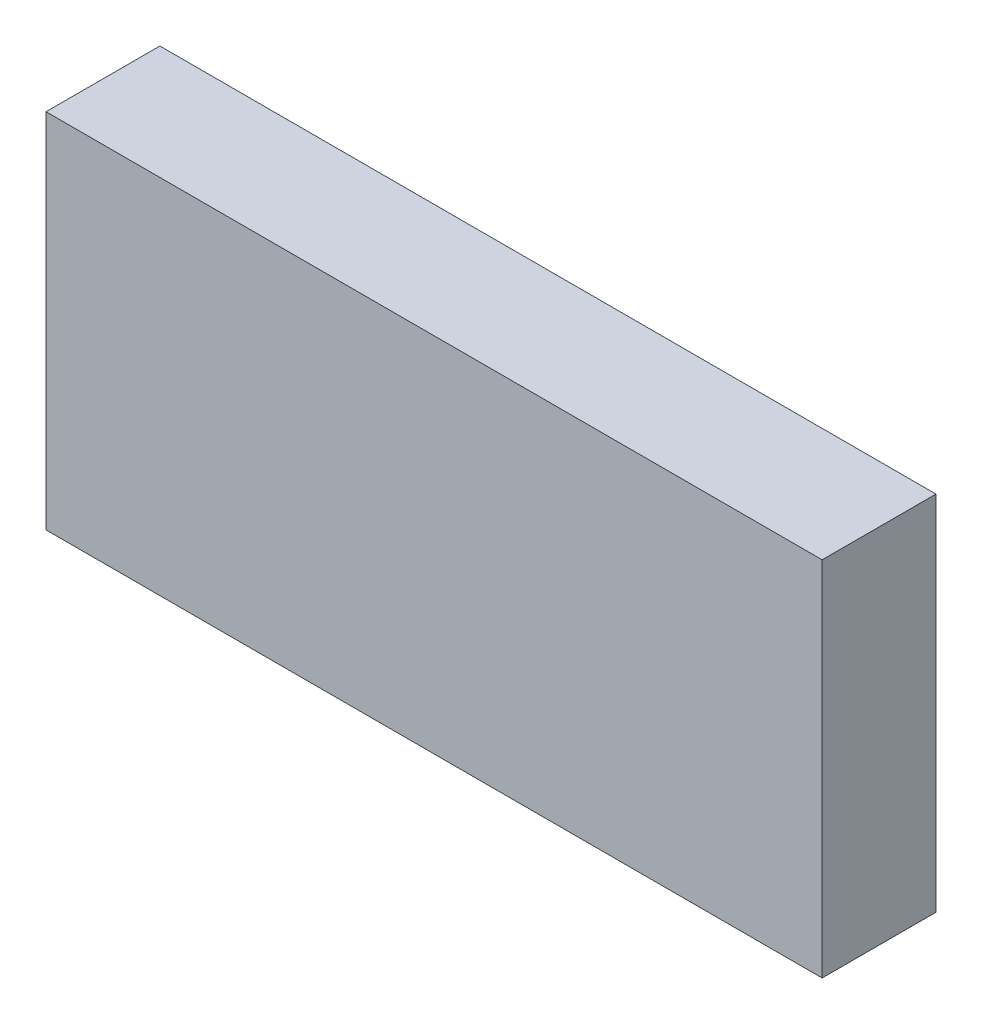
ISO-10303-21;
HEADER;
FILE_DESCRIPTION(('STEP AP214'),'2;1');
FILE_NAME('part.step','',(''),(''),'','','');
FILE_SCHEMA(('AUTOMOTIVE_DESIGN { 1 0 10303 214 1 1 1 1 }'));
ENDSEC;
DATA;
#1=APPLICATION_CONTEXT('core data for automotive mechanical design processes');
#2=APPLICATION_PROTOCOL_DEFINITION('international standard','automotive_design',2000,#1);
#3=PRODUCT_CONTEXT('',#1,'mechanical');
#4=PRODUCT('Part','Part','',(#3));
#5=PRODUCT_RELATED_PRODUCT_CATEGORY('part','',(#4));
#6=PRODUCT_DEFINITION_FORMATION('','',#4);
#7=PRODUCT_DEFINITION_CONTEXT('part definition',#1,'design');
#8=PRODUCT_DEFINITION('design','',#6,#7);
#9=PRODUCT_DEFINITION_SHAPE('','',#8);
#10=(LENGTH_UNIT() NAMED_UNIT(*) SI_UNIT(.MILLI.,.METRE.));
#11=(NAMED_UNIT(*) PLANE_ANGLE_UNIT() SI_UNIT($,.RADIAN.));
#12=(NAMED_UNIT(*) SI_UNIT($,.STERADIAN.) SOLID_ANGLE_UNIT());
#13=UNCERTAINTY_MEASURE_WITH_UNIT(LENGTH_MEASURE(1.E-05),#10,'distance_accuracy_value','');
#14=(GEOMETRIC_REPRESENTATION_CONTEXT(3) GLOBAL_UNCERTAINTY_ASSIGNED_CONTEXT((#13)) GLOBAL_UNIT_ASSIGNED_CONTEXT((#10,
#11,#12)) REPRESENTATION_CONTEXT('',''));
#15=CARTESIAN_POINT('',(0.,0.,0.));
#16=DIRECTION('',(0.,0.,1.));
#17=DIRECTION('',(1.,0.,0.));
#18=AXIS2_PLACEMENT_3D('',#15,#16,#17);
#19=CARTESIAN_POINT('',(75.,35.,22.));
#20=DIRECTION('',(-1.,0.,0.));
#21=DIRECTION('',(0.,0.,1.));
#22=AXIS2_PLACEMENT_3D('',#19,#20,#21);
#23=PLANE('',#22);
#24=DIRECTION('',(0.,1.,0.));
#25=VECTOR('',#24,1.);
#26=CARTESIAN_POINT('',(75.,35.,0.));
#27=LINE('',#26,#25);
#28=CARTESIAN_POINT('',(75.,-35.,0.));
#29=VERTEX_POINT('',#28);
#30=CARTESIAN_POINT('',(75.,35.,0.));
#31=VERTEX_POINT('',#30);
#32=EDGE_CURVE('E96',#29,#31,#27,.T.);
#33=ORIENTED_EDGE('',*,*,#32,.T.);
#34=DIRECTION('',(0.,0.,-1.));
#35=VECTOR('',#34,1.);
#36=CARTESIAN_POINT('',(75.,35.,22.));
#37=LINE('',#36,#35);
#38=CARTESIAN_POINT('',(75.,35.,22.));
#39=VERTEX_POINT('',#38);
#40=EDGE_CURVE('E11',#39,#31,#37,.T.);
#41=ORIENTED_EDGE('',*,*,#40,.F.);
#42=DIRECTION('',(0.,1.,0.));
#43=VECTOR('',#42,1.);
#44=CARTESIAN_POINT('',(75.,35.,22.));
#45=LINE('',#44,#43);
#46=CARTESIAN_POINT('',(75.,-35.,22.));
#47=VERTEX_POINT('',#46);
#48=EDGE_CURVE('E84',#47,#39,#45,.T.);
#49=ORIENTED_EDGE('',*,*,#48,.F.);
#50=DIRECTION('',(0.,0.,-1.));
#51=VECTOR('',#50,1.);
#52=CARTESIAN_POINT('',(75.,-35.,22.));
#53=LINE('',#52,#51);
#54=EDGE_CURVE('E92',#47,#29,#53,.T.);
#55=ORIENTED_EDGE('',*,*,#54,.T.);
#56=EDGE_LOOP('',(#33,#41,#49,#55));
#57=FACE_BOUND('',#56,.T.);
#58=ADVANCED_FACE('F33',(#57),#23,.F.);
#59=CARTESIAN_POINT('',(-75.,35.,22.));
#60=DIRECTION('',(0.,-1.,0.));
#61=DIRECTION('',(0.,0.,-1.));
#62=AXIS2_PLACEMENT_3D('',#59,#60,#61);
#63=PLANE('',#62);
#64=DIRECTION('',(-1.,0.,0.));
#65=VECTOR('',#64,1.);
#66=CARTESIAN_POINT('',(-75.,35.,0.));
#67=LINE('',#66,#65);
#68=CARTESIAN_POINT('',(-75.,35.,0.));
#69=VERTEX_POINT('',#68);
#70=EDGE_CURVE('E88',#31,#69,#67,.T.);
#71=ORIENTED_EDGE('',*,*,#70,.T.);
#72=DIRECTION('',(0.,0.,-1.));
#73=VECTOR('',#72,1.);
#74=CARTESIAN_POINT('',(-75.,35.,22.));
#75=LINE('',#74,#73);
#76=CARTESIAN_POINT('',(-75.,35.,22.));
#77=VERTEX_POINT('',#76);
#78=EDGE_CURVE('E41',#77,#69,#75,.T.);
#79=ORIENTED_EDGE('',*,*,#78,.F.);
#80=DIRECTION('',(-1.,0.,0.));
#81=VECTOR('',#80,1.);
#82=CARTESIAN_POINT('',(-75.,35.,22.));
#83=LINE('',#82,#81);
#84=EDGE_CURVE('E79',#39,#77,#83,.T.);
#85=ORIENTED_EDGE('',*,*,#84,.F.);
#86=ORIENTED_EDGE('',*,*,#40,.T.);
#87=EDGE_LOOP('',(#71,#79,#85,#86));
#88=FACE_BOUND('',#87,.T.);
#89=ADVANCED_FACE('F87',(#88),#63,.F.);
#90=CARTESIAN_POINT('',(-75.,35.,22.));
#91=DIRECTION('',(1.,0.,0.));
#92=DIRECTION('',(0.,1.,0.));
#93=AXIS2_PLACEMENT_3D('',#90,#91,#92);
#94=PLANE('',#93);
#95=DIRECTION('',(0.,-1.,0.));
#96=VECTOR('',#95,1.);
#97=CARTESIAN_POINT('',(-75.,35.,0.));
#98=LINE('',#97,#96);
#99=CARTESIAN_POINT('',(-75.,-35.,0.));
#100=VERTEX_POINT('',#99);
#101=EDGE_CURVE('E66',#69,#100,#98,.T.);
#102=ORIENTED_EDGE('',*,*,#101,.T.);
#103=DIRECTION('',(0.,0.,-1.));
#104=VECTOR('',#103,1.);
#105=CARTESIAN_POINT('',(-75.,-35.,22.));
#106=LINE('',#105,#104);
#107=CARTESIAN_POINT('',(-75.,-35.,22.));
#108=VERTEX_POINT('',#107);
#109=EDGE_CURVE('E89',#108,#100,#106,.T.);
#110=ORIENTED_EDGE('',*,*,#109,.F.);
#111=DIRECTION('',(0.,-1.,0.));
#112=VECTOR('',#111,1.);
#113=CARTESIAN_POINT('',(-75.,35.,22.));
#114=LINE('',#113,#112);
#115=EDGE_CURVE('E82',#77,#108,#114,.T.);
#116=ORIENTED_EDGE('',*,*,#115,.F.);
#117=ORIENTED_EDGE('',*,*,#78,.T.);
#118=EDGE_LOOP('',(#102,#110,#116,#117));
#119=FACE_BOUND('',#118,.T.);
#120=ADVANCED_FACE('F90',(#119),#94,.F.);
#121=CARTESIAN_POINT('',(-75.,-35.,22.));
#122=DIRECTION('',(0.,1.,0.));
#123=DIRECTION('',(0.,0.,1.));
#124=AXIS2_PLACEMENT_3D('',#121,#122,#123);
#125=PLANE('',#124);
#126=DIRECTION('',(1.,0.,0.));
#127=VECTOR('',#126,1.);
#128=CARTESIAN_POINT('',(-75.,-35.,0.));
#129=LINE('',#128,#127);
#130=EDGE_CURVE('E72',#100,#29,#129,.T.);
#131=ORIENTED_EDGE('',*,*,#130,.T.);
#132=ORIENTED_EDGE('',*,*,#54,.F.);
#133=DIRECTION('',(1.,0.,0.));
#134=VECTOR('',#133,1.);
#135=CARTESIAN_POINT('',(-75.,-35.,22.));
#136=LINE('',#135,#134);
#137=EDGE_CURVE('E49',#108,#47,#136,.T.);
#138=ORIENTED_EDGE('',*,*,#137,.F.);
#139=ORIENTED_EDGE('',*,*,#109,.T.);
#140=EDGE_LOOP('',(#131,#132,#138,#139));
#141=FACE_BOUND('',#140,.T.);
#142=ADVANCED_FACE('F103',(#141),#125,.F.);
#143=CARTESIAN_POINT('',(0.,0.,22.));
#144=DIRECTION('',(0.,0.,1.));
#145=DIRECTION('',(1.,0.,0.));
#146=AXIS2_PLACEMENT_3D('',#143,#144,#145);
#147=PLANE('',#146);
#148=ORIENTED_EDGE('',*,*,#48,.T.);
#149=ORIENTED_EDGE('',*,*,#84,.T.);
#150=ORIENTED_EDGE('',*,*,#115,.T.);
#151=ORIENTED_EDGE('',*,*,#137,.T.);
#152=EDGE_LOOP('',(#148,#149,#150,#151));
#153=FACE_BOUND('',#152,.T.);
#154=ADVANCED_FACE('F80',(#153),#147,.T.);
#155=CARTESIAN_POINT('',(0.,0.,0.));
#156=DIRECTION('',(0.,0.,1.));
#157=DIRECTION('',(1.,0.,0.));
#158=AXIS2_PLACEMENT_3D('',#155,#156,#157);
#159=PLANE('',#158);
#160=ORIENTED_EDGE('',*,*,#32,.F.);
#161=ORIENTED_EDGE('',*,*,#130,.F.);
#162=ORIENTED_EDGE('',*,*,#101,.F.);
#163=ORIENTED_EDGE('',*,*,#70,.F.);
#164=EDGE_LOOP('',(#160,#161,#162,#163));
#165=FACE_BOUND('',#164,.T.);
#166=ADVANCED_FACE('F106',(#165),#159,.F.);
#167=CLOSED_SHELL('',(#58,#89,#120,#142,#154,#166));
#168=MANIFOLD_SOLID_BREP('B2',#167);
#169=ADVANCED_BREP_SHAPE_REPRESENTATION('',(#18,#168),#14);
#170=SHAPE_DEFINITION_REPRESENTATION(#9,#169);
ENDSEC;
END-ISO-10303-21;
